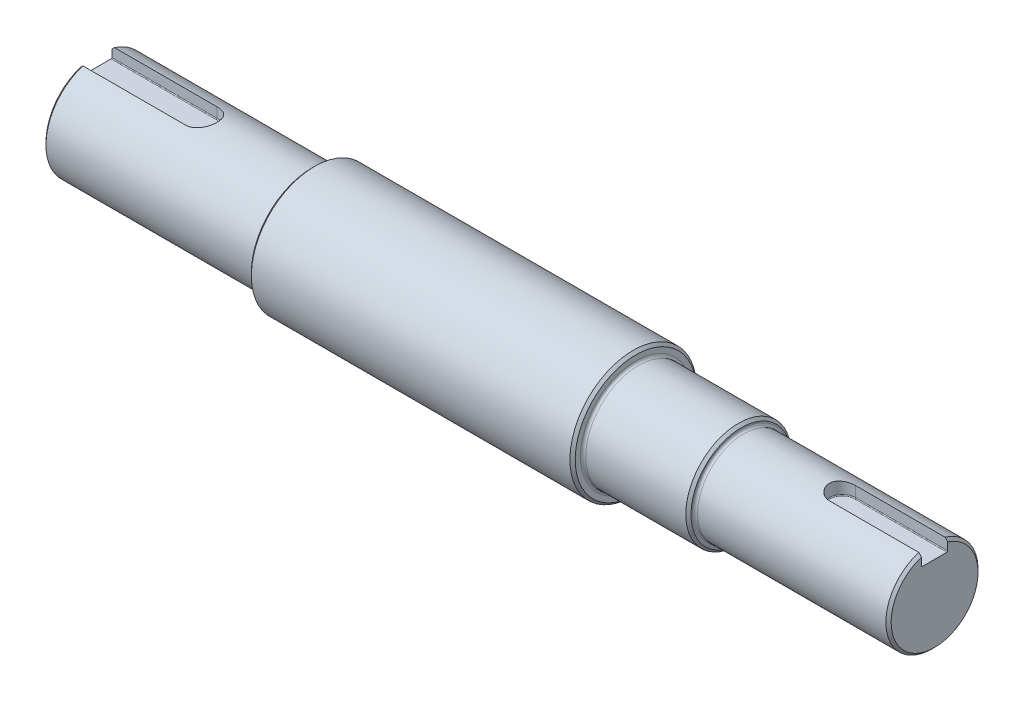
ISO-10303-21;
HEADER;
FILE_DESCRIPTION(('STEP AP214'),'2;1');
FILE_NAME('part.step','',(''),(''),'','','');
FILE_SCHEMA(('AUTOMOTIVE_DESIGN { 1 0 10303 214 1 1 1 1 }'));
ENDSEC;
DATA;
#1=APPLICATION_CONTEXT('core data for automotive mechanical design processes');
#2=APPLICATION_PROTOCOL_DEFINITION('international standard','automotive_design',2000,#1);
#3=PRODUCT_CONTEXT('',#1,'mechanical');
#4=PRODUCT('Part','Part','',(#3));
#5=PRODUCT_RELATED_PRODUCT_CATEGORY('part','',(#4));
#6=PRODUCT_DEFINITION_FORMATION('','',#4);
#7=PRODUCT_DEFINITION_CONTEXT('part definition',#1,'design');
#8=PRODUCT_DEFINITION('design','',#6,#7);
#9=PRODUCT_DEFINITION_SHAPE('','',#8);
#10=(LENGTH_UNIT() NAMED_UNIT(*) SI_UNIT(.MILLI.,.METRE.));
#11=(NAMED_UNIT(*) PLANE_ANGLE_UNIT() SI_UNIT($,.RADIAN.));
#12=(NAMED_UNIT(*) SI_UNIT($,.STERADIAN.) SOLID_ANGLE_UNIT());
#13=UNCERTAINTY_MEASURE_WITH_UNIT(LENGTH_MEASURE(1.E-05),#10,'distance_accuracy_value','');
#14=(GEOMETRIC_REPRESENTATION_CONTEXT(3) GLOBAL_UNCERTAINTY_ASSIGNED_CONTEXT((#13)) GLOBAL_UNIT_ASSIGNED_CONTEXT((#10,
#11,#12)) REPRESENTATION_CONTEXT('',''));
#15=CARTESIAN_POINT('',(0.,0.,0.));
#16=DIRECTION('',(0.,0.,1.));
#17=DIRECTION('',(1.,0.,0.));
#18=AXIS2_PLACEMENT_3D('',#15,#16,#17);
#19=CARTESIAN_POINT('',(-150.,0.,0.));
#20=DIRECTION('',(-1.,0.,0.));
#21=DIRECTION('',(0.,-1.,0.));
#22=AXIS2_PLACEMENT_3D('',#19,#20,#21);
#23=CYLINDRICAL_SURFACE('',#22,17.5);
#24=CARTESIAN_POINT('',(95.9999999999999,0.,0.));
#25=DIRECTION('',(-1.,0.,0.));
#26=DIRECTION('',(0.,-1.,0.));
#27=AXIS2_PLACEMENT_3D('',#24,#25,#26);
#28=CIRCLE('',#27,17.5);
#29=CARTESIAN_POINT('',(95.9999999999999,-17.5,0.));
#30=VERTEX_POINT('',#29);
#31=EDGE_CURVE('E252',#30,#30,#28,.F.);
#32=ORIENTED_EDGE('',*,*,#31,.T.);
#33=EDGE_LOOP('',(#32));
#34=FACE_BOUND('',#33,.T.);
#35=DIRECTION('',(-1.,0.,0.));
#36=VECTOR('',#35,1.);
#37=CARTESIAN_POINT('',(-150.,16.7705098312484,-4.99999999999996));
#38=LINE('',#37,#36);
#39=CARTESIAN_POINT('',(133.5,16.7705098312484,-5.));
#40=VERTEX_POINT('',#39);
#41=CARTESIAN_POINT('',(167.5,16.7705098312484,-4.99999999999996));
#42=VERTEX_POINT('',#41);
#43=EDGE_CURVE('E165',#40,#42,#38,.F.);
#44=ORIENTED_EDGE('',*,*,#43,.T.);
#45=CARTESIAN_POINT('',(167.5,0.,0.));
#46=DIRECTION('',(-1.,0.,0.));
#47=DIRECTION('',(0.,-1.,0.));
#48=AXIS2_PLACEMENT_3D('',#45,#46,#47);
#49=CIRCLE('',#48,17.5);
#50=CARTESIAN_POINT('',(167.5,16.7705098312484,5.00000000000004));
#51=VERTEX_POINT('',#50);
#52=EDGE_CURVE('E164',#42,#51,#49,.T.);
#53=ORIENTED_EDGE('',*,*,#52,.T.);
#54=DIRECTION('',(-1.,0.,0.));
#55=VECTOR('',#54,1.);
#56=CARTESIAN_POINT('',(-150.,16.7705098312484,5.00000000000004));
#57=LINE('',#56,#55);
#58=CARTESIAN_POINT('',(133.5,16.7705098312484,5.));
#59=VERTEX_POINT('',#58);
#60=EDGE_CURVE('E145',#59,#51,#57,.F.);
#61=ORIENTED_EDGE('',*,*,#60,.F.);
#62=CARTESIAN_POINT('',(133.5,16.7705098312484,5.));
#63=CARTESIAN_POINT('',(133.362456233053,16.7704912725158,5.00001814544054));
#64=CARTESIAN_POINT('',(133.224919377977,16.7722013219269,4.99432529208165));
#65=CARTESIAN_POINT('',(132.950888810716,16.7789431019967,4.97165222541634));
#66=CARTESIAN_POINT('',(132.814394888157,16.7839741438635,4.95467435267923));
#67=CARTESIAN_POINT('',(132.543741545981,16.7972068372471,4.90961903685606));
#68=CARTESIAN_POINT('',(132.409577375167,16.8054009743522,4.8815678964473));
#69=CARTESIAN_POINT('',(132.144200358011,16.8247046364186,4.81461674604719));
#70=CARTESIAN_POINT('',(132.012987577578,16.8358142264156,4.7757164940406));
#71=CARTESIAN_POINT('',(131.754468339378,16.8606149796878,4.68740449021954));
#72=CARTESIAN_POINT('',(131.627159944636,16.874304837985,4.63799805032664));
#73=CARTESIAN_POINT('',(131.377200637274,16.9038705765848,4.52905522001707));
#74=CARTESIAN_POINT('',(131.254551476628,16.9197472690052,4.46951506432953));
#75=CARTESIAN_POINT('',(130.894791639693,16.9699997678901,4.27631278448764));
#76=CARTESIAN_POINT('',(130.665701638104,17.007014905076,4.12801150136261));
#77=CARTESIAN_POINT('',(130.229486035131,17.0850471293107,3.79229915782692));
#78=CARTESIAN_POINT('',(130.023079725343,17.1261428352533,3.60397767000145));
#79=CARTESIAN_POINT('',(129.644262306926,17.2070462516998,3.19544341696384));
#80=CARTESIAN_POINT('',(129.471856835959,17.2468537476932,2.97522537348193));
#81=CARTESIAN_POINT('',(129.162921908032,17.3215844019062,2.50410851659381));
#82=CARTESIAN_POINT('',(129.027119075702,17.3564029869975,2.25271539483174));
#83=CARTESIAN_POINT('',(128.799992287608,17.4163145657263,1.72950937060037));
#84=CARTESIAN_POINT('',(128.708657694812,17.4414098849257,1.45770136944962));
#85=CARTESIAN_POINT('',(128.575414299149,17.4784878135792,0.908899275051319));
#86=CARTESIAN_POINT('',(128.53227814541,17.4907954521753,0.632225504452086));
#87=CARTESIAN_POINT('',(128.492783305845,17.5020523750682,0.0753060921048531));
#88=CARTESIAN_POINT('',(128.496416669004,17.5010039299558,-0.204938934421956));
#89=CARTESIAN_POINT('',(128.549515480194,17.4859002467781,-0.752451373530195));
#90=CARTESIAN_POINT('',(128.597652399274,17.4722220494947,-1.01985970934148));
#91=CARTESIAN_POINT('',(128.736240829548,17.433846479088,-1.54263514692819));
#92=CARTESIAN_POINT('',(128.82669447701,17.4091485496606,-1.79800164008104));
#93=CARTESIAN_POINT('',(129.048266371266,17.3509771517082,-2.29267928834746));
#94=CARTESIAN_POINT('',(129.179818952082,17.3174105731756,-2.53178407311226));
#95=CARTESIAN_POINT('',(129.479644333575,17.2450626129451,-2.98504901208545));
#96=CARTESIAN_POINT('',(129.647924587276,17.2062801734237,-3.19920408978384));
#97=CARTESIAN_POINT('',(129.927627358824,17.1465202223136,-3.50113424709604));
#98=CARTESIAN_POINT('',(130.027363864346,17.1259700648702,-3.60007423743549));
#99=CARTESIAN_POINT('',(130.23482024234,17.0851123940087,-3.78923134613088));
#100=CARTESIAN_POINT('',(130.34253733987,17.0648047990745,-3.8794514715687));
#101=CARTESIAN_POINT('',(130.565345040993,17.0249868857383,-4.05062437518904));
#102=CARTESIAN_POINT('',(130.680440529872,17.005477109874,-4.13157091233146));
#103=CARTESIAN_POINT('',(130.917160793701,16.9678346429649,-4.28353981460234));
#104=CARTESIAN_POINT('',(131.038783003334,16.9497014175386,-4.35456603991597));
#105=CARTESIAN_POINT('',(131.288915951318,16.9151829895461,-4.48679157824971));
#106=CARTESIAN_POINT('',(131.417478627797,16.898814896638,-4.54789718496758));
#107=CARTESIAN_POINT('',(131.67954149636,16.8685251216221,-4.65898872141543));
#108=CARTESIAN_POINT('',(131.813039657761,16.8546024466245,-4.70897916633161));
#109=CARTESIAN_POINT('',(132.083921011356,16.829649854127,-4.79739484975372));
#110=CARTESIAN_POINT('',(132.221299979259,16.8186169160755,-4.835832170633));
#111=CARTESIAN_POINT('',(132.498995545652,16.7997865631929,-4.90084834749728));
#112=CARTESIAN_POINT('',(132.639310751519,16.7919876494693,-4.92743269748004));
#113=CARTESIAN_POINT('',(132.899665114212,16.7808301521248,-4.96528740578586));
#114=CARTESIAN_POINT('',(133.019431629728,16.776966894118,-4.97830600651657));
#115=CARTESIAN_POINT('',(133.259462294816,16.7718034889731,-4.99566040544727));
#116=CARTESIAN_POINT('',(133.379725403777,16.7704994326599,-5.0000094465416));
#117=CARTESIAN_POINT('',(133.5,16.7705098312484,-5.));
#118=B_SPLINE_CURVE_WITH_KNOTS('',3,(#62,#63,#64,#65,#66,#67,#68,#69,#70,#71,#72,#73,#74,#75,
#76,#77,#78,#79,#80,#81,#82,#83,#84,#85,#86,#87,#88,#89,#90,#91,#92,#93,#94,#95,#96,#97,#98,#99,
#100,#101,#102,#103,#104,#105,#106,#107,#108,#109,#110,#111,#112,#113,#114,#115,#116,#117),
.UNSPECIFIED.,.F.,.F.,(4,2,2,2,2,2,2,2,2,2,2,2,2,2,2,2,2,2,2,2,2,2,2,2,2,2,2,4),(0.,
0.41249217880454,0.824898831357961,1.2363317198125,1.64777378699038,2.0590083218504,
2.47039598941267,3.29264569343989,4.13611232627187,4.97971869650209,5.83900986868947,
6.69809539287325,7.53476732988531,8.37129703101928,9.18363381655586,9.99601161556284,
10.8172828992968,11.6387209961027,12.0642579015972,12.489647531354,12.9153217832843,
13.3408299328975,13.7701489130554,14.1992931759112,14.6279870611799,15.056482034464,
15.4177510461265,15.7784677892953),.UNSPECIFIED.);
#119=EDGE_CURVE('E154',#59,#40,#118,.T.);
#120=ORIENTED_EDGE('',*,*,#119,.T.);
#121=EDGE_LOOP('',(#44,#53,#61,#120));
#122=FACE_BOUND('',#121,.T.);
#123=ADVANCED_FACE('F37',(#34,#122),#23,.T.);
#124=CARTESIAN_POINT('',(-150.,0.,0.));
#125=DIRECTION('',(-1.,0.,0.));
#126=DIRECTION('',(0.,-1.,0.));
#127=AXIS2_PLACEMENT_3D('',#124,#125,#126);
#128=CYLINDRICAL_SURFACE('',#127,20.);
#129=CARTESIAN_POINT('',(-69.,0.,0.));
#130=DIRECTION('',(1.,0.,0.));
#131=DIRECTION('',(0.,1.,0.));
#132=AXIS2_PLACEMENT_3D('',#129,#130,#131);
#133=CIRCLE('',#132,20.);
#134=CARTESIAN_POINT('',(-69.,20.,0.));
#135=VERTEX_POINT('',#134);
#136=EDGE_CURVE('E45',#135,#135,#133,.F.);
#137=ORIENTED_EDGE('',*,*,#136,.T.);
#138=EDGE_LOOP('',(#137));
#139=FACE_BOUND('',#138,.T.);
#140=DIRECTION('',(-1.,0.,0.));
#141=VECTOR('',#140,1.);
#142=CARTESIAN_POINT('',(-150.,19.0787840283389,6.));
#143=LINE('',#142,#141);
#144=CARTESIAN_POINT('',(-110.,19.0787840283389,6.));
#145=VERTEX_POINT('',#144);
#146=CARTESIAN_POINT('',(-149.,19.0787840283389,6.));
#147=VERTEX_POINT('',#146);
#148=EDGE_CURVE('E196',#145,#147,#143,.T.);
#149=ORIENTED_EDGE('',*,*,#148,.T.);
#150=CARTESIAN_POINT('',(-149.,0.,0.));
#151=DIRECTION('',(1.,0.,0.));
#152=DIRECTION('',(0.,1.,0.));
#153=AXIS2_PLACEMENT_3D('',#150,#151,#152);
#154=CIRCLE('',#153,20.);
#155=CARTESIAN_POINT('',(-149.,19.0787840283389,-6.));
#156=VERTEX_POINT('',#155);
#157=EDGE_CURVE('E52',#147,#156,#154,.T.);
#158=ORIENTED_EDGE('',*,*,#157,.T.);
#159=DIRECTION('',(-1.,0.,0.));
#160=VECTOR('',#159,1.);
#161=CARTESIAN_POINT('',(-150.,19.0787840283389,-6.));
#162=LINE('',#161,#160);
#163=CARTESIAN_POINT('',(-110.,19.0787840283389,-6.));
#164=VERTEX_POINT('',#163);
#165=EDGE_CURVE('E450',#164,#156,#162,.T.);
#166=ORIENTED_EDGE('',*,*,#165,.F.);
#167=CARTESIAN_POINT('',(-110.,19.0787840283389,-6.));
#168=CARTESIAN_POINT('',(-109.835332005089,19.0787603919218,-6.00002230630953));
#169=CARTESIAN_POINT('',(-109.67067261307,19.0809150948054,-5.99322212828861));
#170=CARTESIAN_POINT('',(-109.342610571615,19.089408588524,-5.96614198358438));
#171=CARTESIAN_POINT('',(-109.179207647986,19.0957464386677,-5.94586504749982));
#172=CARTESIAN_POINT('',(-108.855233206316,19.1124126760415,-5.89206455668659));
#173=CARTESIAN_POINT('',(-108.694655572036,19.1227309292375,-5.85857463708937));
#174=CARTESIAN_POINT('',(-108.377037691332,19.1470349488515,-5.77865096251378));
#175=CARTESIAN_POINT('',(-108.219997537531,19.1610208111801,-5.73221686903431));
#176=CARTESIAN_POINT('',(-107.910617439277,19.1922338155173,-5.62682620459484));
#177=CARTESIAN_POINT('',(-107.758274781224,19.2094590438083,-5.56787702452552));
#178=CARTESIAN_POINT('',(-107.459125857098,19.2466621419291,-5.43788252899624));
#179=CARTESIAN_POINT('',(-107.312321675672,19.2666410353108,-5.36683271334057));
#180=CARTESIAN_POINT('',(-107.025215054747,19.3087849542851,-5.21317247195195));
#181=CARTESIAN_POINT('',(-106.88491298147,19.3309501027959,-5.13056139609832));
#182=CARTESIAN_POINT('',(-106.611612201325,19.3768680311909,-4.95431913401972));
#183=CARTESIAN_POINT('',(-106.478616283128,19.4006214097184,-4.8606837822377));
#184=CARTESIAN_POINT('',(-106.21713642677,19.4497584548899,-4.66024014290222));
#185=CARTESIAN_POINT('',(-106.088884847802,19.4751691904069,-4.55313526362689));
#186=CARTESIAN_POINT('',(-105.841746062991,19.5263015189751,-4.32860344600266));
#187=CARTESIAN_POINT('',(-105.722862133329,19.5520232171847,-4.21117292654718));
#188=CARTESIAN_POINT('',(-105.495258604878,19.6030710031715,-3.96676059198591));
#189=CARTESIAN_POINT('',(-105.386539067971,19.6283970885393,-3.83977871873938));
#190=CARTESIAN_POINT('',(-105.179980745528,19.6779706962222,-3.5770569657621));
#191=CARTESIAN_POINT('',(-105.082141874161,19.7022182270443,-3.44131715512969));
#192=CARTESIAN_POINT('',(-104.89609023174,19.7494715734221,-3.15899953964077));
#193=CARTESIAN_POINT('',(-104.808121953698,19.7724407517412,-3.01225429870654));
#194=CARTESIAN_POINT('',(-104.644936205945,19.8159158974823,-2.71155717798052));
#195=CARTESIAN_POINT('',(-104.569714021433,19.8364227748921,-2.55760798995096));
#196=CARTESIAN_POINT('',(-104.432583560629,19.8744001644265,-2.24348996032481));
#197=CARTESIAN_POINT('',(-104.370677745232,19.8918701152059,-2.08331997555619));
#198=CARTESIAN_POINT('',(-104.260762497544,19.923254535561,-1.75801430484773));
#199=CARTESIAN_POINT('',(-104.212747060032,19.9371705413066,-1.59288079897389));
#200=CARTESIAN_POINT('',(-104.132174453272,19.960709769643,-1.26354510595574));
#201=CARTESIAN_POINT('',(-104.099219373042,19.9704430293701,-1.09944808925078));
#202=CARTESIAN_POINT('',(-104.047128002714,19.9858966495547,-0.768952154148948));
#203=CARTESIAN_POINT('',(-104.027986195865,19.9916186120195,-0.602554181799293));
#204=CARTESIAN_POINT('',(-104.003680035143,19.9988929276978,-0.268644299740227));
#205=CARTESIAN_POINT('',(-103.998516105694,20.0004451543012,-0.101132356360973));
#206=CARTESIAN_POINT('',(-104.002216405079,19.9993350985709,0.233720900410862));
#207=CARTESIAN_POINT('',(-104.011080376463,19.9966728935831,0.401062216878505));
#208=CARTESIAN_POINT('',(-104.042242211602,19.9873626800314,0.72894994040031));
#209=CARTESIAN_POINT('',(-104.064100009983,19.9808452710305,0.889542117296656));
#210=CARTESIAN_POINT('',(-104.120695481758,19.9641050678088,1.20830021014906));
#211=CARTESIAN_POINT('',(-104.155437542225,19.9538810115069,1.36646528055415));
#212=CARTESIAN_POINT('',(-104.23749230161,19.9300014175933,1.67917461818939));
#213=CARTESIAN_POINT('',(-104.284800775723,19.916347033335,1.83372008335732));
#214=CARTESIAN_POINT('',(-104.391630271063,19.885954581515,2.13828018933735));
#215=CARTESIAN_POINT('',(-104.451155883997,19.8692153547843,2.28829310223871));
#216=CARTESIAN_POINT('',(-104.582690579539,19.8328818557961,2.58443507880942));
#217=CARTESIAN_POINT('',(-104.654832897198,19.8132575095082,2.7305012482212));
#218=CARTESIAN_POINT('',(-104.81062314733,19.7717979578185,3.01609632375421));
#219=CARTESIAN_POINT('',(-104.894275028384,19.7499619943591,3.15562296424242));
#220=CARTESIAN_POINT('',(-105.072486982441,19.704643118031,3.42724384686892));
#221=CARTESIAN_POINT('',(-105.167047181428,19.681160186142,3.55933800314028));
#222=CARTESIAN_POINT('',(-105.366458678429,19.6331439703208,3.81531376455357));
#223=CARTESIAN_POINT('',(-105.471310276501,19.6086106557752,3.93919513006485));
#224=CARTESIAN_POINT('',(-105.694897243463,19.5581593507452,4.18263653591652));
#225=CARTESIAN_POINT('',(-105.814012679474,19.5322244988475,4.30184428600934));
#226=CARTESIAN_POINT('',(-106.061833503502,19.4806179410542,4.52981041510267));
#227=CARTESIAN_POINT('',(-106.190535796081,19.454946153239,4.63857214120816));
#228=CARTESIAN_POINT('',(-106.456840396239,19.4045581786367,4.84504126060966));
#229=CARTESIAN_POINT('',(-106.594448571901,19.3798426394128,4.94274124635232));
#230=CARTESIAN_POINT('',(-106.877559092333,19.3321023379674,5.12628631686324));
#231=CARTESIAN_POINT('',(-107.023058337578,19.3090769201297,5.21213600998877));
#232=CARTESIAN_POINT('',(-107.322635135093,19.2651525602885,5.37223080367566));
#233=CARTESIAN_POINT('',(-107.476787078659,19.2442786555291,5.44634371437402));
#234=CARTESIAN_POINT('',(-107.791121841361,19.2055937237889,5.58122691640504));
#235=CARTESIAN_POINT('',(-107.951302162478,19.1877814448102,5.64200266456204));
#236=CARTESIAN_POINT('',(-108.27643211835,19.1557967477957,5.74966145349631));
#237=CARTESIAN_POINT('',(-108.441376526563,19.1416204978023,5.79655912825487));
#238=CARTESIAN_POINT('',(-108.774893180451,19.1173543231183,5.87609462586438));
#239=CARTESIAN_POINT('',(-108.943463715049,19.1072625137754,5.90873902604377));
#240=CARTESIAN_POINT('',(-109.259937070237,19.0925703406668,5.95603131732401));
#241=CARTESIAN_POINT('',(-109.40754170936,19.0874107715083,5.97251971262426));
#242=CARTESIAN_POINT('',(-109.703427112475,19.0805126306352,5.99450261914156));
#243=CARTESIAN_POINT('',(-109.851706559575,19.0787690288453,6.00001329545509));
#244=CARTESIAN_POINT('',(-110.,19.0787840283389,6.));
#245=B_SPLINE_CURVE_WITH_KNOTS('',3,(#167,#168,#169,#170,#171,#172,#173,#174,#175,#176,#177,
#178,#179,#180,#181,#182,#183,#184,#185,#186,#187,#188,#189,#190,#191,#192,#193,#194,#195,#196,
#197,#198,#199,#200,#201,#202,#203,#204,#205,#206,#207,#208,#209,#210,#211,#212,#213,#214,#215,
#216,#217,#218,#219,#220,#221,#222,#223,#224,#225,#226,#227,#228,#229,#230,#231,#232,#233,#234,
#235,#236,#237,#238,#239,#240,#241,#242,#243,#244),.UNSPECIFIED.,.F.,.F.,(4,2,2,2,2,2,2,2,2,2,2,
2,2,2,2,2,2,2,2,2,2,2,2,2,2,2,2,2,2,2,2,2,2,2,2,2,2,2,4),(0.,0.493836284878934,
0.987561555412188,1.48003801924603,1.97252736296405,2.4647266679518,2.95710942192587,
3.44951987503684,3.94211698773001,4.44857898474592,4.95521732942467,5.46185875834846,
5.96849619046395,6.48574341264194,7.00279888450885,7.51994982748059,8.03687685551445,
8.53921958328378,9.04136157401789,9.5435188116382,10.0456668334346,10.531706521874,
11.0179118582603,11.5039539397551,11.9901790315928,12.4818885441265,12.9737671698834,
13.4656514771114,13.9575501300996,14.4684682486942,14.9792221093922,15.4903160010787,
16.001210574562,16.517502934493,17.0335836608614,17.549118241575,18.0644146711719,
18.5098131233961,18.9545552237083),.UNSPECIFIED.);
#246=EDGE_CURVE('E181',#164,#145,#245,.T.);
#247=ORIENTED_EDGE('',*,*,#246,.T.);
#248=EDGE_LOOP('',(#149,#158,#166,#247));
#249=FACE_BOUND('',#248,.T.);
#250=ADVANCED_FACE('F198',(#139,#249),#128,.T.);
#251=CARTESIAN_POINT('',(-150.,0.,0.));
#252=DIRECTION('',(1.,0.,0.));
#253=DIRECTION('',(0.,1.,0.));
#254=AXIS2_PLACEMENT_3D('',#251,#252,#253);
#255=PLANE('',#254);
#256=DIRECTION('',(0.,1.,0.));
#257=VECTOR('',#256,1.);
#258=CARTESIAN_POINT('',(-150.,15.,-6.));
#259=LINE('',#258,#257);
#260=CARTESIAN_POINT('',(-150.,15.3,-6.));
#261=VERTEX_POINT('',#260);
#262=CARTESIAN_POINT('',(-150.,18.0277563773199,-6.));
#263=VERTEX_POINT('',#262);
#264=EDGE_CURVE('E182',#261,#263,#259,.T.);
#265=ORIENTED_EDGE('',*,*,#264,.T.);
#266=CARTESIAN_POINT('',(-150.,0.,0.));
#267=DIRECTION('',(1.,0.,0.));
#268=DIRECTION('',(0.,1.,0.));
#269=AXIS2_PLACEMENT_3D('',#266,#267,#268);
#270=CIRCLE('',#269,19.);
#271=CARTESIAN_POINT('',(-150.,18.0277563773199,6.));
#272=VERTEX_POINT('',#271);
#273=EDGE_CURVE('E226',#263,#272,#270,.F.);
#274=ORIENTED_EDGE('',*,*,#273,.T.);
#275=DIRECTION('',(0.,1.,0.));
#276=VECTOR('',#275,1.);
#277=CARTESIAN_POINT('',(-150.,15.,6.));
#278=LINE('',#277,#276);
#279=CARTESIAN_POINT('',(-150.,15.3,6.));
#280=VERTEX_POINT('',#279);
#281=EDGE_CURVE('E179',#280,#272,#278,.T.);
#282=ORIENTED_EDGE('',*,*,#281,.F.);
#283=CARTESIAN_POINT('',(-150.,15.3,5.7));
#284=DIRECTION('',(1.,0.,0.));
#285=DIRECTION('',(0.,1.,0.));
#286=AXIS2_PLACEMENT_3D('',#283,#284,#285);
#287=CIRCLE('',#286,0.3);
#288=CARTESIAN_POINT('',(-150.,15.,5.7));
#289=VERTEX_POINT('',#288);
#290=EDGE_CURVE('E433',#280,#289,#287,.T.);
#291=ORIENTED_EDGE('',*,*,#290,.T.);
#292=DIRECTION('',(0.,0.,1.));
#293=VECTOR('',#292,1.);
#294=CARTESIAN_POINT('',(-150.,15.,0.));
#295=LINE('',#294,#293);
#296=CARTESIAN_POINT('',(-150.,15.,-5.7));
#297=VERTEX_POINT('',#296);
#298=EDGE_CURVE('E174',#297,#289,#295,.T.);
#299=ORIENTED_EDGE('',*,*,#298,.F.);
#300=CARTESIAN_POINT('',(-150.,15.3,-5.7));
#301=DIRECTION('',(1.,0.,0.));
#302=DIRECTION('',(0.,1.,0.));
#303=AXIS2_PLACEMENT_3D('',#300,#301,#302);
#304=CIRCLE('',#303,0.3);
#305=EDGE_CURVE('E160',#297,#261,#304,.T.);
#306=ORIENTED_EDGE('',*,*,#305,.T.);
#307=EDGE_LOOP('',(#265,#274,#282,#291,#299,#306));
#308=FACE_BOUND('',#307,.T.);
#309=ADVANCED_FACE('F277',(#308),#255,.F.);
#310=CARTESIAN_POINT('',(-68.,20.,0.));
#311=DIRECTION('',(1.,0.,0.));
#312=DIRECTION('',(0.,1.,0.));
#313=AXIS2_PLACEMENT_3D('',#310,#311,#312);
#314=PLANE('',#313);
#315=CARTESIAN_POINT('',(-68.,0.,0.));
#316=DIRECTION('',(1.,0.,0.));
#317=DIRECTION('',(0.,1.,0.));
#318=AXIS2_PLACEMENT_3D('',#315,#316,#317);
#319=CIRCLE('',#318,21.);
#320=CARTESIAN_POINT('',(-68.,21.,0.));
#321=VERTEX_POINT('',#320);
#322=EDGE_CURVE('E11',#321,#321,#319,.T.);
#323=ORIENTED_EDGE('',*,*,#322,.T.);
#324=EDGE_LOOP('',(#323));
#325=FACE_BOUND('',#324,.T.);
#326=CARTESIAN_POINT('',(-68.,0.,0.));
#327=DIRECTION('',(1.,0.,0.));
#328=DIRECTION('',(0.,1.,0.));
#329=AXIS2_PLACEMENT_3D('',#326,#327,#328);
#330=CIRCLE('',#329,23.);
#331=CARTESIAN_POINT('',(-68.,23.,0.));
#332=VERTEX_POINT('',#331);
#333=EDGE_CURVE('E406',#332,#332,#330,.F.);
#334=ORIENTED_EDGE('',*,*,#333,.T.);
#335=EDGE_LOOP('',(#334));
#336=FACE_BOUND('',#335,.T.);
#337=ADVANCED_FACE('F646',(#325,#336),#314,.F.);
#338=CARTESIAN_POINT('',(-150.,0.,0.));
#339=DIRECTION('',(-1.,0.,0.));
#340=DIRECTION('',(0.,-1.,0.));
#341=AXIS2_PLACEMENT_3D('',#338,#339,#340);
#342=CYLINDRICAL_SURFACE('',#341,24.);
#343=CARTESIAN_POINT('',(53.9999999999999,0.,0.));
#344=DIRECTION('',(-1.,0.,0.));
#345=DIRECTION('',(0.,-1.,0.));
#346=AXIS2_PLACEMENT_3D('',#343,#344,#345);
#347=CIRCLE('',#346,24.);
#348=CARTESIAN_POINT('',(53.9999999999999,-24.,0.));
#349=VERTEX_POINT('',#348);
#350=EDGE_CURVE('E398',#349,#349,#347,.T.);
#351=ORIENTED_EDGE('',*,*,#350,.T.);
#352=EDGE_LOOP('',(#351));
#353=FACE_BOUND('',#352,.T.);
#354=CARTESIAN_POINT('',(-67.0000000000001,0.,0.));
#355=DIRECTION('',(1.,0.,0.));
#356=DIRECTION('',(0.,1.,0.));
#357=AXIS2_PLACEMENT_3D('',#354,#355,#356);
#358=CIRCLE('',#357,24.);
#359=CARTESIAN_POINT('',(-67.0000000000001,24.,0.));
#360=VERTEX_POINT('',#359);
#361=EDGE_CURVE('E396',#360,#360,#358,.T.);
#362=ORIENTED_EDGE('',*,*,#361,.T.);
#363=EDGE_LOOP('',(#362));
#364=FACE_BOUND('',#363,.T.);
#365=ADVANCED_FACE('F638',(#353,#364),#342,.T.);
#366=CARTESIAN_POINT('',(55.,24.,0.));
#367=DIRECTION('',(-1.,0.,0.));
#368=DIRECTION('',(0.,-1.,0.));
#369=AXIS2_PLACEMENT_3D('',#366,#367,#368);
#370=PLANE('',#369);
#371=CARTESIAN_POINT('',(55.,0.,0.));
#372=DIRECTION('',(-1.,0.,0.));
#373=DIRECTION('',(0.,-1.,0.));
#374=AXIS2_PLACEMENT_3D('',#371,#372,#373);
#375=CIRCLE('',#374,21.);
#376=CARTESIAN_POINT('',(55.,-21.,0.));
#377=VERTEX_POINT('',#376);
#378=EDGE_CURVE('E255',#377,#377,#375,.T.);
#379=ORIENTED_EDGE('',*,*,#378,.T.);
#380=EDGE_LOOP('',(#379));
#381=FACE_BOUND('',#380,.T.);
#382=CARTESIAN_POINT('',(55.,0.,0.));
#383=DIRECTION('',(-1.,0.,0.));
#384=DIRECTION('',(0.,-1.,0.));
#385=AXIS2_PLACEMENT_3D('',#382,#383,#384);
#386=CIRCLE('',#385,23.);
#387=CARTESIAN_POINT('',(55.,-23.,0.));
#388=VERTEX_POINT('',#387);
#389=EDGE_CURVE('E404',#388,#388,#386,.F.);
#390=ORIENTED_EDGE('',*,*,#389,.T.);
#391=EDGE_LOOP('',(#390));
#392=FACE_BOUND('',#391,.T.);
#393=ADVANCED_FACE('F388',(#381,#392),#370,.F.);
#394=CARTESIAN_POINT('',(-150.,0.,0.));
#395=DIRECTION('',(-1.,0.,0.));
#396=DIRECTION('',(0.,-1.,0.));
#397=AXIS2_PLACEMENT_3D('',#394,#395,#396);
#398=CYLINDRICAL_SURFACE('',#397,20.);
#399=CARTESIAN_POINT('',(56.,0.,0.));
#400=DIRECTION('',(-1.,0.,0.));
#401=DIRECTION('',(0.,-1.,0.));
#402=AXIS2_PLACEMENT_3D('',#399,#400,#401);
#403=CIRCLE('',#402,20.);
#404=CARTESIAN_POINT('',(56.,-20.,0.));
#405=VERTEX_POINT('',#404);
#406=EDGE_CURVE('E258',#405,#405,#403,.F.);
#407=ORIENTED_EDGE('',*,*,#406,.T.);
#408=EDGE_LOOP('',(#407));
#409=FACE_BOUND('',#408,.T.);
#410=CARTESIAN_POINT('',(93.9999999999999,0.,0.));
#411=DIRECTION('',(-1.,0.,0.));
#412=DIRECTION('',(0.,-1.,0.));
#413=AXIS2_PLACEMENT_3D('',#410,#411,#412);
#414=CIRCLE('',#413,20.);
#415=CARTESIAN_POINT('',(93.9999999999999,-20.,0.));
#416=VERTEX_POINT('',#415);
#417=EDGE_CURVE('E311',#416,#416,#414,.T.);
#418=ORIENTED_EDGE('',*,*,#417,.T.);
#419=EDGE_LOOP('',(#418));
#420=FACE_BOUND('',#419,.T.);
#421=ADVANCED_FACE('F383',(#409,#420),#398,.T.);
#422=CARTESIAN_POINT('',(94.9999999999999,20.,0.));
#423=DIRECTION('',(-1.,0.,0.));
#424=DIRECTION('',(0.,-1.,0.));
#425=AXIS2_PLACEMENT_3D('',#422,#423,#424);
#426=PLANE('',#425);
#427=CARTESIAN_POINT('',(94.9999999999999,0.,0.));
#428=DIRECTION('',(-1.,0.,0.));
#429=DIRECTION('',(0.,-1.,0.));
#430=AXIS2_PLACEMENT_3D('',#427,#428,#429);
#431=CIRCLE('',#430,18.5);
#432=CARTESIAN_POINT('',(94.9999999999999,-18.5,0.));
#433=VERTEX_POINT('',#432);
#434=EDGE_CURVE('E249',#433,#433,#431,.T.);
#435=ORIENTED_EDGE('',*,*,#434,.T.);
#436=EDGE_LOOP('',(#435));
#437=FACE_BOUND('',#436,.T.);
#438=CARTESIAN_POINT('',(94.9999999999999,0.,0.));
#439=DIRECTION('',(-1.,0.,0.));
#440=DIRECTION('',(0.,-1.,0.));
#441=AXIS2_PLACEMENT_3D('',#438,#439,#440);
#442=CIRCLE('',#441,19.);
#443=CARTESIAN_POINT('',(94.9999999999999,-19.,0.));
#444=VERTEX_POINT('',#443);
#445=EDGE_CURVE('E394',#444,#444,#442,.F.);
#446=ORIENTED_EDGE('',*,*,#445,.T.);
#447=EDGE_LOOP('',(#446));
#448=FACE_BOUND('',#447,.T.);
#449=ADVANCED_FACE('F280',(#437,#448),#426,.F.);
#450=CARTESIAN_POINT('',(168.5,17.5,0.));
#451=DIRECTION('',(-1.,0.,0.));
#452=DIRECTION('',(0.,-1.,0.));
#453=AXIS2_PLACEMENT_3D('',#450,#451,#452);
#454=PLANE('',#453);
#455=DIRECTION('',(0.,1.,0.));
#456=VECTOR('',#455,1.);
#457=CARTESIAN_POINT('',(168.5,12.5,5.));
#458=LINE('',#457,#456);
#459=CARTESIAN_POINT('',(168.5,12.8,5.));
#460=VERTEX_POINT('',#459);
#461=CARTESIAN_POINT('',(168.5,15.7241851935163,5.));
#462=VERTEX_POINT('',#461);
#463=EDGE_CURVE('E150',#460,#462,#458,.T.);
#464=ORIENTED_EDGE('',*,*,#463,.T.);
#465=CARTESIAN_POINT('',(168.5,0.,0.));
#466=DIRECTION('',(-1.,0.,0.));
#467=DIRECTION('',(0.,-1.,0.));
#468=AXIS2_PLACEMENT_3D('',#465,#466,#467);
#469=CIRCLE('',#468,16.5);
#470=CARTESIAN_POINT('',(168.5,15.7241851935163,-5.));
#471=VERTEX_POINT('',#470);
#472=EDGE_CURVE('E312',#462,#471,#469,.F.);
#473=ORIENTED_EDGE('',*,*,#472,.T.);
#474=DIRECTION('',(0.,1.,0.));
#475=VECTOR('',#474,1.);
#476=CARTESIAN_POINT('',(168.5,12.5,-5.));
#477=LINE('',#476,#475);
#478=CARTESIAN_POINT('',(168.5,12.8,-5.));
#479=VERTEX_POINT('',#478);
#480=EDGE_CURVE('E166',#479,#471,#477,.T.);
#481=ORIENTED_EDGE('',*,*,#480,.F.);
#482=CARTESIAN_POINT('',(168.5,12.8,-4.7));
#483=DIRECTION('',(-1.,0.,0.));
#484=DIRECTION('',(0.,-1.,0.));
#485=AXIS2_PLACEMENT_3D('',#482,#483,#484);
#486=CIRCLE('',#485,0.3);
#487=CARTESIAN_POINT('',(168.5,12.5,-4.7));
#488=VERTEX_POINT('',#487);
#489=EDGE_CURVE('E337',#479,#488,#486,.T.);
#490=ORIENTED_EDGE('',*,*,#489,.T.);
#491=DIRECTION('',(0.,0.,-1.));
#492=VECTOR('',#491,1.);
#493=CARTESIAN_POINT('',(168.5,12.5,0.));
#494=LINE('',#493,#492);
#495=CARTESIAN_POINT('',(168.5,12.5,4.7));
#496=VERTEX_POINT('',#495);
#497=EDGE_CURVE('E341',#496,#488,#494,.T.);
#498=ORIENTED_EDGE('',*,*,#497,.F.);
#499=CARTESIAN_POINT('',(168.5,12.8,4.7));
#500=DIRECTION('',(-1.,0.,0.));
#501=DIRECTION('',(0.,-1.,0.));
#502=AXIS2_PLACEMENT_3D('',#499,#500,#501);
#503=CIRCLE('',#502,0.3);
#504=EDGE_CURVE('E345',#496,#460,#503,.T.);
#505=ORIENTED_EDGE('',*,*,#504,.T.);
#506=EDGE_LOOP('',(#464,#473,#481,#490,#498,#505));
#507=FACE_BOUND('',#506,.T.);
#508=ADVANCED_FACE('F216',(#507),#454,.F.);
#509=CARTESIAN_POINT('',(0.,15.,6.));
#510=DIRECTION('',(0.,0.,1.));
#511=DIRECTION('',(1.,0.,0.));
#512=AXIS2_PLACEMENT_3D('',#509,#510,#511);
#513=PLANE('',#512);
#514=ORIENTED_EDGE('',*,*,#281,.T.);
#515=CARTESIAN_POINT('',(-150.,18.0277563773199,6.));
#516=CARTESIAN_POINT('',(-149.833568082781,18.203151008636,6.));
#517=CARTESIAN_POINT('',(-149.667018789877,18.3784339628861,6.));
#518=CARTESIAN_POINT('',(-149.333685456538,18.7287765132206,6.));
#519=CARTESIAN_POINT('',(-149.166901416109,18.9038361093102,6.));
#520=CARTESIAN_POINT('',(-149.,19.0787840283389,6.));
#521=B_SPLINE_CURVE_WITH_KNOTS('',3,(#515,#516,#517,#518,#519,#520),.UNSPECIFIED.,.F.,.F.,(4,2,
4),(0.,0.725372338289978,1.45074465987786),.UNSPECIFIED.);
#522=EDGE_CURVE('E60',#272,#147,#521,.T.);
#523=ORIENTED_EDGE('',*,*,#522,.T.);
#524=ORIENTED_EDGE('',*,*,#148,.F.);
#525=DIRECTION('',(0.,1.,0.));
#526=VECTOR('',#525,1.);
#527=CARTESIAN_POINT('',(-110.,15.,6.));
#528=LINE('',#527,#526);
#529=CARTESIAN_POINT('',(-110.,15.3,6.));
#530=VERTEX_POINT('',#529);
#531=EDGE_CURVE('E177',#530,#145,#528,.T.);
#532=ORIENTED_EDGE('',*,*,#531,.F.);
#533=DIRECTION('',(1.,0.,0.));
#534=VECTOR('',#533,1.);
#535=CARTESIAN_POINT('',(0.,15.3,6.));
#536=LINE('',#535,#534);
#537=EDGE_CURVE('E419',#530,#280,#536,.F.);
#538=ORIENTED_EDGE('',*,*,#537,.T.);
#539=EDGE_LOOP('',(#514,#523,#524,#532,#538));
#540=FACE_BOUND('',#539,.T.);
#541=ADVANCED_FACE('F212',(#540),#513,.F.);
#542=CARTESIAN_POINT('',(0.,15.,-6.));
#543=DIRECTION('',(0.,0.,1.));
#544=DIRECTION('',(1.,0.,0.));
#545=AXIS2_PLACEMENT_3D('',#542,#543,#544);
#546=PLANE('',#545);
#547=ORIENTED_EDGE('',*,*,#165,.T.);
#548=CARTESIAN_POINT('',(-149.,19.0787840283389,-6.));
#549=CARTESIAN_POINT('',(-149.166901416109,18.9038361093102,-6.));
#550=CARTESIAN_POINT('',(-149.333685456538,18.7287765132206,-6.));
#551=CARTESIAN_POINT('',(-149.667018789877,18.3784339628861,-6.));
#552=CARTESIAN_POINT('',(-149.833568082781,18.203151008636,-6.));
#553=CARTESIAN_POINT('',(-150.,18.0277563773199,-6.));
#554=B_SPLINE_CURVE_WITH_KNOTS('',3,(#548,#549,#550,#551,#552,#553),.UNSPECIFIED.,.F.,.F.,(4,2,
4),(0.,0.725372321587878,1.45074465987786),.UNSPECIFIED.);
#555=EDGE_CURVE('E243',#156,#263,#554,.T.);
#556=ORIENTED_EDGE('',*,*,#555,.T.);
#557=ORIENTED_EDGE('',*,*,#264,.F.);
#558=DIRECTION('',(1.,0.,0.));
#559=VECTOR('',#558,1.);
#560=CARTESIAN_POINT('',(-110.,15.3,-6.));
#561=LINE('',#560,#559);
#562=CARTESIAN_POINT('',(-110.,15.3,-6.));
#563=VERTEX_POINT('',#562);
#564=EDGE_CURVE('E425',#261,#563,#561,.T.);
#565=ORIENTED_EDGE('',*,*,#564,.T.);
#566=DIRECTION('',(0.,1.,0.));
#567=VECTOR('',#566,1.);
#568=CARTESIAN_POINT('',(-110.,15.,-6.));
#569=LINE('',#568,#567);
#570=EDGE_CURVE('E185',#563,#164,#569,.T.);
#571=ORIENTED_EDGE('',*,*,#570,.T.);
#572=EDGE_LOOP('',(#547,#556,#557,#565,#571));
#573=FACE_BOUND('',#572,.T.);
#574=ADVANCED_FACE('F208',(#573),#546,.T.);
#575=CARTESIAN_POINT('',(-110.,15.,0.));
#576=DIRECTION('',(0.,1.,0.));
#577=DIRECTION('',(-1.,0.,0.));
#578=AXIS2_PLACEMENT_3D('',#575,#576,#577);
#579=CYLINDRICAL_SURFACE('',#578,6.);
#580=ORIENTED_EDGE('',*,*,#570,.F.);
#581=CARTESIAN_POINT('',(-110.,15.3,0.));
#582=DIRECTION('',(0.,1.,0.));
#583=DIRECTION('',(0.,0.,1.));
#584=AXIS2_PLACEMENT_3D('',#581,#582,#583);
#585=CIRCLE('',#584,6.);
#586=EDGE_CURVE('E422',#563,#530,#585,.F.);
#587=ORIENTED_EDGE('',*,*,#586,.T.);
#588=ORIENTED_EDGE('',*,*,#531,.T.);
#589=ORIENTED_EDGE('',*,*,#246,.F.);
#590=EDGE_LOOP('',(#580,#587,#588,#589));
#591=FACE_BOUND('',#590,.T.);
#592=ADVANCED_FACE('F202',(#591),#579,.F.);
#593=CARTESIAN_POINT('',(0.,15.,0.));
#594=DIRECTION('',(0.,1.,0.));
#595=DIRECTION('',(0.,0.,1.));
#596=AXIS2_PLACEMENT_3D('',#593,#594,#595);
#597=PLANE('',#596);
#598=ORIENTED_EDGE('',*,*,#298,.T.);
#599=DIRECTION('',(1.,0.,0.));
#600=VECTOR('',#599,1.);
#601=CARTESIAN_POINT('',(0.,15.,5.7));
#602=LINE('',#601,#600);
#603=CARTESIAN_POINT('',(-110.,15.,5.7));
#604=VERTEX_POINT('',#603);
#605=EDGE_CURVE('E423',#289,#604,#602,.T.);
#606=ORIENTED_EDGE('',*,*,#605,.T.);
#607=CARTESIAN_POINT('',(-110.,15.,0.));
#608=DIRECTION('',(0.,1.,0.));
#609=DIRECTION('',(0.,0.,1.));
#610=AXIS2_PLACEMENT_3D('',#607,#608,#609);
#611=CIRCLE('',#610,5.7);
#612=CARTESIAN_POINT('',(-110.,15.,-5.7));
#613=VERTEX_POINT('',#612);
#614=EDGE_CURVE('E428',#604,#613,#611,.T.);
#615=ORIENTED_EDGE('',*,*,#614,.T.);
#616=DIRECTION('',(1.,0.,0.));
#617=VECTOR('',#616,1.);
#618=CARTESIAN_POINT('',(-150.,15.,-5.7));
#619=LINE('',#618,#617);
#620=EDGE_CURVE('E447',#613,#297,#619,.F.);
#621=ORIENTED_EDGE('',*,*,#620,.T.);
#622=EDGE_LOOP('',(#598,#606,#615,#621));
#623=FACE_BOUND('',#622,.T.);
#624=ADVANCED_FACE('F207',(#623),#597,.T.);
#625=CARTESIAN_POINT('',(0.,15.3,-5.7));
#626=DIRECTION('',(-1.,0.,0.));
#627=DIRECTION('',(0.,0.,1.));
#628=AXIS2_PLACEMENT_3D('',#625,#626,#627);
#629=CYLINDRICAL_SURFACE('',#628,0.3);
#630=ORIENTED_EDGE('',*,*,#305,.F.);
#631=ORIENTED_EDGE('',*,*,#620,.F.);
#632=CARTESIAN_POINT('',(-110.,15.3,-5.7));
#633=DIRECTION('',(-1.,0.,0.));
#634=DIRECTION('',(0.,0.,1.));
#635=AXIS2_PLACEMENT_3D('',#632,#633,#634);
#636=CIRCLE('',#635,0.3);
#637=EDGE_CURVE('E178',#563,#613,#636,.T.);
#638=ORIENTED_EDGE('',*,*,#637,.F.);
#639=ORIENTED_EDGE('',*,*,#564,.F.);
#640=EDGE_LOOP('',(#630,#631,#638,#639));
#641=FACE_BOUND('',#640,.T.);
#642=ADVANCED_FACE('F446',(#641),#629,.F.);
#643=CARTESIAN_POINT('',(-110.,15.3,0.));
#644=DIRECTION('',(0.,1.,0.));
#645=DIRECTION('',(0.,0.,1.));
#646=AXIS2_PLACEMENT_3D('',#643,#644,#645);
#647=TOROIDAL_SURFACE('',#646,5.7,0.3);
#648=ORIENTED_EDGE('',*,*,#637,.T.);
#649=ORIENTED_EDGE('',*,*,#614,.F.);
#650=CARTESIAN_POINT('',(-110.,15.3,5.7));
#651=DIRECTION('',(1.,0.,0.));
#652=DIRECTION('',(0.,0.,-1.));
#653=AXIS2_PLACEMENT_3D('',#650,#651,#652);
#654=CIRCLE('',#653,0.3);
#655=EDGE_CURVE('E168',#530,#604,#654,.T.);
#656=ORIENTED_EDGE('',*,*,#655,.F.);
#657=ORIENTED_EDGE('',*,*,#586,.F.);
#658=EDGE_LOOP('',(#648,#649,#656,#657));
#659=FACE_BOUND('',#658,.T.);
#660=ADVANCED_FACE('F441',(#659),#647,.F.);
#661=CARTESIAN_POINT('',(0.,15.3,5.7));
#662=DIRECTION('',(1.,0.,0.));
#663=DIRECTION('',(0.,0.,-1.));
#664=AXIS2_PLACEMENT_3D('',#661,#662,#663);
#665=CYLINDRICAL_SURFACE('',#664,0.3);
#666=ORIENTED_EDGE('',*,*,#290,.F.);
#667=ORIENTED_EDGE('',*,*,#537,.F.);
#668=ORIENTED_EDGE('',*,*,#655,.T.);
#669=ORIENTED_EDGE('',*,*,#605,.F.);
#670=EDGE_LOOP('',(#666,#667,#668,#669));
#671=FACE_BOUND('',#670,.T.);
#672=ADVANCED_FACE('F296',(#671),#665,.F.);
#673=CARTESIAN_POINT('',(133.5,12.5,0.));
#674=DIRECTION('',(0.,1.,0.));
#675=DIRECTION('',(-1.,0.,0.));
#676=AXIS2_PLACEMENT_3D('',#673,#674,#675);
#677=CYLINDRICAL_SURFACE('',#676,5.);
#678=DIRECTION('',(0.,1.,0.));
#679=VECTOR('',#678,1.);
#680=CARTESIAN_POINT('',(133.5,12.5,5.));
#681=LINE('',#680,#679);
#682=CARTESIAN_POINT('',(133.5,12.8,5.));
#683=VERTEX_POINT('',#682);
#684=EDGE_CURVE('E141',#683,#59,#681,.T.);
#685=ORIENTED_EDGE('',*,*,#684,.F.);
#686=CARTESIAN_POINT('',(133.5,12.8,0.));
#687=DIRECTION('',(0.,1.,0.));
#688=DIRECTION('',(0.,0.,1.));
#689=AXIS2_PLACEMENT_3D('',#686,#687,#688);
#690=CIRCLE('',#689,5.);
#691=CARTESIAN_POINT('',(133.5,12.8,-5.));
#692=VERTEX_POINT('',#691);
#693=EDGE_CURVE('E349',#683,#692,#690,.F.);
#694=ORIENTED_EDGE('',*,*,#693,.T.);
#695=DIRECTION('',(0.,1.,0.));
#696=VECTOR('',#695,1.);
#697=CARTESIAN_POINT('',(133.5,12.5,-5.));
#698=LINE('',#697,#696);
#699=EDGE_CURVE('E151',#692,#40,#698,.T.);
#700=ORIENTED_EDGE('',*,*,#699,.T.);
#701=ORIENTED_EDGE('',*,*,#119,.F.);
#702=EDGE_LOOP('',(#685,#694,#700,#701));
#703=FACE_BOUND('',#702,.T.);
#704=ADVANCED_FACE('F155',(#703),#677,.F.);
#705=CARTESIAN_POINT('',(0.,12.5,-4.99999999999998));
#706=DIRECTION('',(0.,0.,-1.));
#707=DIRECTION('',(-1.,0.,0.));
#708=AXIS2_PLACEMENT_3D('',#705,#706,#707);
#709=PLANE('',#708);
#710=ORIENTED_EDGE('',*,*,#480,.T.);
#711=CARTESIAN_POINT('',(168.5,15.7241851935163,-5.));
#712=CARTESIAN_POINT('',(168.333576186561,15.8988047391192,-5.));
#713=CARTESIAN_POINT('',(168.167030945317,16.0733082329734,-5.));
#714=CARTESIAN_POINT('',(167.833697611977,16.4220831122108,-5.));
#715=CARTESIAN_POINT('',(167.666909519887,16.5963544976006,-5.));
#716=CARTESIAN_POINT('',(167.5,16.7705098312484,-5.));
#717=B_SPLINE_CURVE_WITH_KNOTS('',3,(#711,#712,#713,#714,#715,#716),.UNSPECIFIED.,.F.,.F.,(4,2,
4),(0.,0.723670560913285,1.4473411011863),.UNSPECIFIED.);
#718=EDGE_CURVE('E303',#471,#42,#717,.T.);
#719=ORIENTED_EDGE('',*,*,#718,.T.);
#720=ORIENTED_EDGE('',*,*,#43,.F.);
#721=ORIENTED_EDGE('',*,*,#699,.F.);
#722=DIRECTION('',(-1.,0.,0.));
#723=VECTOR('',#722,1.);
#724=CARTESIAN_POINT('',(0.,12.8,-4.99999999999998));
#725=LINE('',#724,#723);
#726=EDGE_CURVE('E347',#692,#479,#725,.F.);
#727=ORIENTED_EDGE('',*,*,#726,.T.);
#728=EDGE_LOOP('',(#710,#719,#720,#721,#727));
#729=FACE_BOUND('',#728,.T.);
#730=ADVANCED_FACE('F295',(#729),#709,.F.);
#731=CARTESIAN_POINT('',(0.,12.5,5.00000000000002));
#732=DIRECTION('',(0.,0.,-1.));
#733=DIRECTION('',(-1.,0.,0.));
#734=AXIS2_PLACEMENT_3D('',#731,#732,#733);
#735=PLANE('',#734);
#736=ORIENTED_EDGE('',*,*,#60,.T.);
#737=CARTESIAN_POINT('',(167.5,16.7705098312484,5.00000000000004));
#738=CARTESIAN_POINT('',(167.666909519887,16.5963544976006,5.00000000000002));
#739=CARTESIAN_POINT('',(167.833697611977,16.4220831122108,5.00000000000001));
#740=CARTESIAN_POINT('',(168.167030945317,16.0733082329734,4.99999999999999));
#741=CARTESIAN_POINT('',(168.333576186561,15.8988047391192,4.99999999999999));
#742=CARTESIAN_POINT('',(168.5,15.7241851935164,5.));
#743=B_SPLINE_CURVE_WITH_KNOTS('',3,(#737,#738,#739,#740,#741,#742),.UNSPECIFIED.,.F.,.F.,(4,2,
4),(0.,0.723670540273008,1.44734110118629),.UNSPECIFIED.);
#744=EDGE_CURVE('E330',#51,#462,#743,.T.);
#745=ORIENTED_EDGE('',*,*,#744,.T.);
#746=ORIENTED_EDGE('',*,*,#463,.F.);
#747=DIRECTION('',(-1.,0.,0.));
#748=VECTOR('',#747,1.);
#749=CARTESIAN_POINT('',(133.5,12.8,5.));
#750=LINE('',#749,#748);
#751=EDGE_CURVE('E148',#460,#683,#750,.T.);
#752=ORIENTED_EDGE('',*,*,#751,.T.);
#753=ORIENTED_EDGE('',*,*,#684,.T.);
#754=EDGE_LOOP('',(#736,#745,#746,#752,#753));
#755=FACE_BOUND('',#754,.T.);
#756=ADVANCED_FACE('F143',(#755),#735,.T.);
#757=CARTESIAN_POINT('',(0.,12.5,0.));
#758=DIRECTION('',(0.,1.,0.));
#759=DIRECTION('',(0.,0.,1.));
#760=AXIS2_PLACEMENT_3D('',#757,#758,#759);
#761=PLANE('',#760);
#762=CARTESIAN_POINT('',(133.5,12.5,0.));
#763=DIRECTION('',(0.,1.,0.));
#764=DIRECTION('',(0.,0.,1.));
#765=AXIS2_PLACEMENT_3D('',#762,#763,#764);
#766=CIRCLE('',#765,4.7);
#767=CARTESIAN_POINT('',(133.5,12.5,-4.7));
#768=VERTEX_POINT('',#767);
#769=CARTESIAN_POINT('',(133.5,12.5,4.7));
#770=VERTEX_POINT('',#769);
#771=EDGE_CURVE('E353',#768,#770,#766,.T.);
#772=ORIENTED_EDGE('',*,*,#771,.T.);
#773=DIRECTION('',(-1.,0.,0.));
#774=VECTOR('',#773,1.);
#775=CARTESIAN_POINT('',(168.5,12.5,4.7));
#776=LINE('',#775,#774);
#777=EDGE_CURVE('E351',#770,#496,#776,.F.);
#778=ORIENTED_EDGE('',*,*,#777,.T.);
#779=ORIENTED_EDGE('',*,*,#497,.T.);
#780=DIRECTION('',(-1.,0.,0.));
#781=VECTOR('',#780,1.);
#782=CARTESIAN_POINT('',(0.,12.5,-4.69999999999998));
#783=LINE('',#782,#781);
#784=EDGE_CURVE('E354',#488,#768,#783,.T.);
#785=ORIENTED_EDGE('',*,*,#784,.T.);
#786=EDGE_LOOP('',(#772,#778,#779,#785));
#787=FACE_BOUND('',#786,.T.);
#788=ADVANCED_FACE('F359',(#787),#761,.T.);
#789=CARTESIAN_POINT('',(0.,12.8,-4.69999999999998));
#790=DIRECTION('',(-1.,0.,0.));
#791=DIRECTION('',(0.,0.,1.));
#792=AXIS2_PLACEMENT_3D('',#789,#790,#791);
#793=CYLINDRICAL_SURFACE('',#792,0.3);
#794=ORIENTED_EDGE('',*,*,#489,.F.);
#795=ORIENTED_EDGE('',*,*,#726,.F.);
#796=CARTESIAN_POINT('',(133.5,12.8,-4.7));
#797=DIRECTION('',(1.,0.,0.));
#798=DIRECTION('',(0.,0.,-1.));
#799=AXIS2_PLACEMENT_3D('',#796,#797,#798);
#800=CIRCLE('',#799,0.3);
#801=EDGE_CURVE('E338',#768,#692,#800,.T.);
#802=ORIENTED_EDGE('',*,*,#801,.F.);
#803=ORIENTED_EDGE('',*,*,#784,.F.);
#804=EDGE_LOOP('',(#794,#795,#802,#803));
#805=FACE_BOUND('',#804,.T.);
#806=ADVANCED_FACE('F327',(#805),#793,.F.);
#807=CARTESIAN_POINT('',(133.5,12.8,0.));
#808=DIRECTION('',(0.,1.,0.));
#809=DIRECTION('',(0.,0.,1.));
#810=AXIS2_PLACEMENT_3D('',#807,#808,#809);
#811=TOROIDAL_SURFACE('',#810,4.7,0.3);
#812=ORIENTED_EDGE('',*,*,#801,.T.);
#813=ORIENTED_EDGE('',*,*,#693,.F.);
#814=CARTESIAN_POINT('',(133.5,12.8,4.7));
#815=DIRECTION('',(-1.,0.,0.));
#816=DIRECTION('',(0.,0.,1.));
#817=AXIS2_PLACEMENT_3D('',#814,#815,#816);
#818=CIRCLE('',#817,0.3);
#819=EDGE_CURVE('E342',#770,#683,#818,.T.);
#820=ORIENTED_EDGE('',*,*,#819,.F.);
#821=ORIENTED_EDGE('',*,*,#771,.F.);
#822=EDGE_LOOP('',(#812,#813,#820,#821));
#823=FACE_BOUND('',#822,.T.);
#824=ADVANCED_FACE('F369',(#823),#811,.F.);
#825=CARTESIAN_POINT('',(0.,12.8,4.70000000000002));
#826=DIRECTION('',(1.,0.,0.));
#827=DIRECTION('',(0.,0.,-1.));
#828=AXIS2_PLACEMENT_3D('',#825,#826,#827);
#829=CYLINDRICAL_SURFACE('',#828,0.3);
#830=ORIENTED_EDGE('',*,*,#504,.F.);
#831=ORIENTED_EDGE('',*,*,#777,.F.);
#832=ORIENTED_EDGE('',*,*,#819,.T.);
#833=ORIENTED_EDGE('',*,*,#751,.F.);
#834=EDGE_LOOP('',(#830,#831,#832,#833));
#835=FACE_BOUND('',#834,.T.);
#836=ADVANCED_FACE('F325',(#835),#829,.F.);
#837=CARTESIAN_POINT('',(167.5,0.,0.));
#838=DIRECTION('',(-1.,0.,0.));
#839=DIRECTION('',(0.,-1.,0.));
#840=AXIS2_PLACEMENT_3D('',#837,#838,#839);
#841=CONICAL_SURFACE('',#840,17.5,0.785398163397422);
#842=ORIENTED_EDGE('',*,*,#718,.F.);
#843=ORIENTED_EDGE('',*,*,#472,.F.);
#844=ORIENTED_EDGE('',*,*,#744,.F.);
#845=ORIENTED_EDGE('',*,*,#52,.F.);
#846=EDGE_LOOP('',(#842,#843,#844,#845));
#847=FACE_BOUND('',#846,.T.);
#848=ADVANCED_FACE('F316',(#847),#841,.T.);
#849=CARTESIAN_POINT('',(93.9999999999999,0.,0.));
#850=DIRECTION('',(-1.,0.,0.));
#851=DIRECTION('',(0.,-1.,0.));
#852=AXIS2_PLACEMENT_3D('',#849,#850,#851);
#853=CONICAL_SURFACE('',#852,20.,0.785398163397438);
#854=ORIENTED_EDGE('',*,*,#445,.F.);
#855=EDGE_LOOP('',(#854));
#856=FACE_BOUND('',#855,.T.);
#857=ORIENTED_EDGE('',*,*,#417,.F.);
#858=EDGE_LOOP('',(#857));
#859=FACE_BOUND('',#858,.T.);
#860=ADVANCED_FACE('F324',(#856,#859),#853,.T.);
#861=CARTESIAN_POINT('',(53.9999999999999,0.,0.));
#862=DIRECTION('',(-1.,0.,0.));
#863=DIRECTION('',(0.,-1.,0.));
#864=AXIS2_PLACEMENT_3D('',#861,#862,#863);
#865=CONICAL_SURFACE('',#864,24.,0.785398163397438);
#866=ORIENTED_EDGE('',*,*,#389,.F.);
#867=EDGE_LOOP('',(#866));
#868=FACE_BOUND('',#867,.T.);
#869=ORIENTED_EDGE('',*,*,#350,.F.);
#870=EDGE_LOOP('',(#869));
#871=FACE_BOUND('',#870,.T.);
#872=ADVANCED_FACE('F532',(#868,#871),#865,.T.);
#873=CARTESIAN_POINT('',(-68.,0.,0.));
#874=DIRECTION('',(1.,0.,0.));
#875=DIRECTION('',(0.,1.,0.));
#876=AXIS2_PLACEMENT_3D('',#873,#874,#875);
#877=CONICAL_SURFACE('',#876,23.,0.785398163397447);
#878=ORIENTED_EDGE('',*,*,#361,.F.);
#879=EDGE_LOOP('',(#878));
#880=FACE_BOUND('',#879,.T.);
#881=ORIENTED_EDGE('',*,*,#333,.F.);
#882=EDGE_LOOP('',(#881));
#883=FACE_BOUND('',#882,.T.);
#884=ADVANCED_FACE('F239',(#880,#883),#877,.T.);
#885=CARTESIAN_POINT('',(-150.,0.,0.));
#886=DIRECTION('',(1.,0.,0.));
#887=DIRECTION('',(0.,1.,0.));
#888=AXIS2_PLACEMENT_3D('',#885,#886,#887);
#889=CONICAL_SURFACE('',#888,19.,0.785398163397426);
#890=ORIENTED_EDGE('',*,*,#555,.F.);
#891=ORIENTED_EDGE('',*,*,#157,.F.);
#892=ORIENTED_EDGE('',*,*,#522,.F.);
#893=ORIENTED_EDGE('',*,*,#273,.F.);
#894=EDGE_LOOP('',(#890,#891,#892,#893));
#895=FACE_BOUND('',#894,.T.);
#896=ADVANCED_FACE('F230',(#895),#889,.T.);
#897=CARTESIAN_POINT('',(95.9999999999999,0.,0.));
#898=DIRECTION('',(-1.,0.,0.));
#899=DIRECTION('',(0.,-1.,0.));
#900=AXIS2_PLACEMENT_3D('',#897,#898,#899);
#901=TOROIDAL_SURFACE('',#900,18.5,1.);
#902=ORIENTED_EDGE('',*,*,#31,.F.);
#903=EDGE_LOOP('',(#902));
#904=FACE_BOUND('',#903,.T.);
#905=ORIENTED_EDGE('',*,*,#434,.F.);
#906=EDGE_LOOP('',(#905));
#907=FACE_BOUND('',#906,.T.);
#908=ADVANCED_FACE('F238',(#904,#907),#901,.F.);
#909=CARTESIAN_POINT('',(56.,0.,0.));
#910=DIRECTION('',(-1.,0.,0.));
#911=DIRECTION('',(0.,-1.,0.));
#912=AXIS2_PLACEMENT_3D('',#909,#910,#911);
#913=TOROIDAL_SURFACE('',#912,21.,1.);
#914=ORIENTED_EDGE('',*,*,#406,.F.);
#915=EDGE_LOOP('',(#914));
#916=FACE_BOUND('',#915,.T.);
#917=ORIENTED_EDGE('',*,*,#378,.F.);
#918=EDGE_LOOP('',(#917));
#919=FACE_BOUND('',#918,.T.);
#920=ADVANCED_FACE('F265',(#916,#919),#913,.F.);
#921=CARTESIAN_POINT('',(-69.,0.,0.));
#922=DIRECTION('',(1.,0.,0.));
#923=DIRECTION('',(0.,1.,0.));
#924=AXIS2_PLACEMENT_3D('',#921,#922,#923);
#925=TOROIDAL_SURFACE('',#924,21.,1.);
#926=ORIENTED_EDGE('',*,*,#322,.F.);
#927=EDGE_LOOP('',(#926));
#928=FACE_BOUND('',#927,.T.);
#929=ORIENTED_EDGE('',*,*,#136,.F.);
#930=EDGE_LOOP('',(#929));
#931=FACE_BOUND('',#930,.T.);
#932=ADVANCED_FACE('F39',(#928,#931),#925,.F.);
#933=CLOSED_SHELL('',(#123,#250,#309,#337,#365,#393,#421,#449,#508,#541,#574,#592,#624,#642,
#660,#672,#704,#730,#756,#788,#806,#824,#836,#848,#860,#872,#884,#896,#908,#920,#932));
#934=MANIFOLD_SOLID_BREP('B2',#933);
#935=ADVANCED_BREP_SHAPE_REPRESENTATION('',(#18,#934),#14);
#936=SHAPE_DEFINITION_REPRESENTATION(#9,#935);
ENDSEC;
END-ISO-10303-21;
